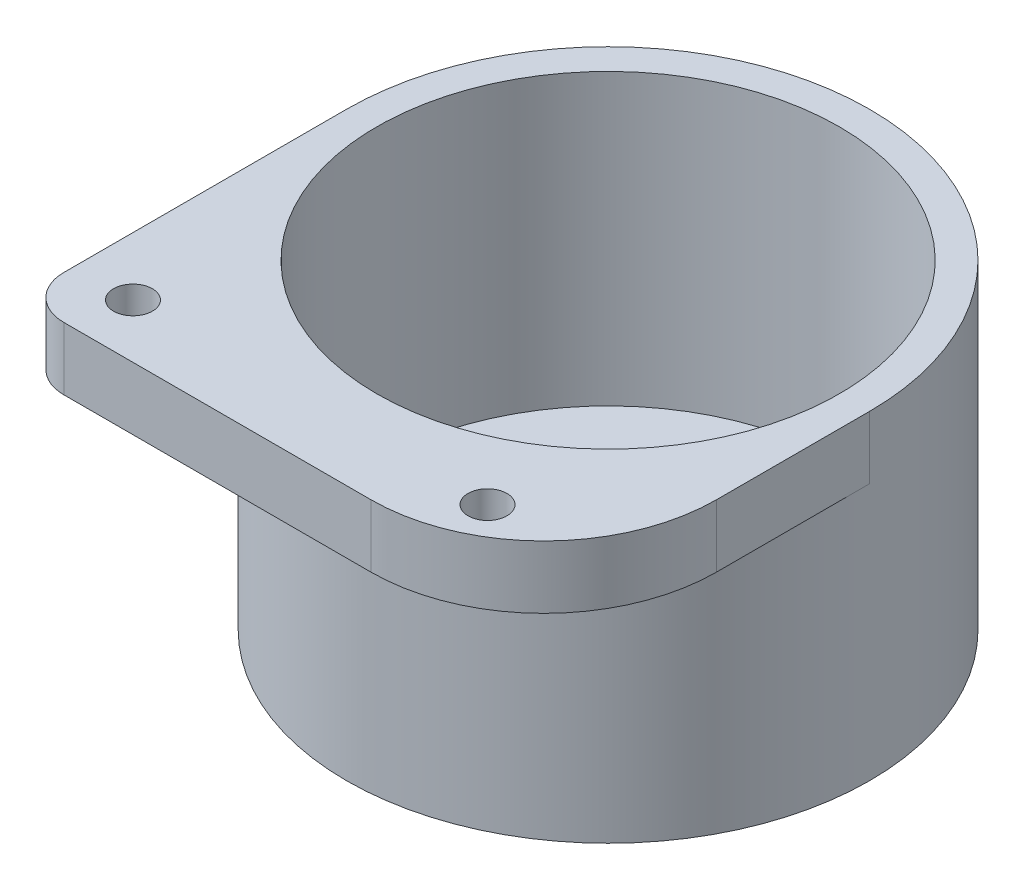
ISO-10303-21;
HEADER;
FILE_DESCRIPTION(('STEP AP214'),'2;1');
FILE_NAME('part.step','',(''),(''),'','','');
FILE_SCHEMA(('AUTOMOTIVE_DESIGN { 1 0 10303 214 1 1 1 1 }'));
ENDSEC;
DATA;
#1=APPLICATION_CONTEXT('core data for automotive mechanical design processes');
#2=APPLICATION_PROTOCOL_DEFINITION('international standard','automotive_design',2000,#1);
#3=PRODUCT_CONTEXT('',#1,'mechanical');
#4=PRODUCT('Part','Part','',(#3));
#5=PRODUCT_RELATED_PRODUCT_CATEGORY('part','',(#4));
#6=PRODUCT_DEFINITION_FORMATION('','',#4);
#7=PRODUCT_DEFINITION_CONTEXT('part definition',#1,'design');
#8=PRODUCT_DEFINITION('design','',#6,#7);
#9=PRODUCT_DEFINITION_SHAPE('','',#8);
#10=(LENGTH_UNIT() NAMED_UNIT(*) SI_UNIT(.MILLI.,.METRE.));
#11=(NAMED_UNIT(*) PLANE_ANGLE_UNIT() SI_UNIT($,.RADIAN.));
#12=(NAMED_UNIT(*) SI_UNIT($,.STERADIAN.) SOLID_ANGLE_UNIT());
#13=UNCERTAINTY_MEASURE_WITH_UNIT(LENGTH_MEASURE(1.E-05),#10,'distance_accuracy_value','');
#14=(GEOMETRIC_REPRESENTATION_CONTEXT(3) GLOBAL_UNCERTAINTY_ASSIGNED_CONTEXT((#13)) GLOBAL_UNIT_ASSIGNED_CONTEXT((#10,
#11,#12)) REPRESENTATION_CONTEXT('',''));
#15=CARTESIAN_POINT('',(0.,0.,0.));
#16=DIRECTION('',(0.,0.,1.));
#17=DIRECTION('',(1.,0.,0.));
#18=AXIS2_PLACEMENT_3D('',#15,#16,#17);
#19=CARTESIAN_POINT('',(0.,7.,0.));
#20=DIRECTION('',(0.,-1.,0.));
#21=DIRECTION('',(0.,0.,-1.));
#22=AXIS2_PLACEMENT_3D('',#19,#20,#21);
#23=CYLINDRICAL_SURFACE('',#22,60.5);
#24=CARTESIAN_POINT('',(0.,0.,0.));
#25=DIRECTION('',(0.,1.,0.));
#26=DIRECTION('',(0.,0.,1.));
#27=AXIS2_PLACEMENT_3D('',#24,#25,#26);
#28=CIRCLE('',#27,60.5);
#29=CARTESIAN_POINT('',(0.,0.,60.5));
#30=VERTEX_POINT('',#29);
#31=EDGE_CURVE('E49',#30,#30,#28,.T.);
#32=ORIENTED_EDGE('',*,*,#31,.T.);
#33=EDGE_LOOP('',(#32));
#34=FACE_BOUND('',#33,.T.);
#35=DIRECTION('',(0.,1.,0.));
#36=VECTOR('',#35,1.);
#37=CARTESIAN_POINT('',(-60.5,59.5,0.));
#38=LINE('',#37,#36);
#39=CARTESIAN_POINT('',(-60.5,59.5,0.));
#40=VERTEX_POINT('',#39);
#41=CARTESIAN_POINT('',(-60.5,74.,0.));
#42=VERTEX_POINT('',#41);
#43=EDGE_CURVE('E115',#40,#42,#38,.T.);
#44=ORIENTED_EDGE('',*,*,#43,.T.);
#45=CARTESIAN_POINT('',(0.,74.,0.));
#46=DIRECTION('',(0.,1.,0.));
#47=DIRECTION('',(0.,0.,1.));
#48=AXIS2_PLACEMENT_3D('',#45,#46,#47);
#49=CIRCLE('',#48,60.5);
#50=CARTESIAN_POINT('',(60.5,74.,0.));
#51=VERTEX_POINT('',#50);
#52=EDGE_CURVE('E189',#51,#42,#49,.T.);
#53=ORIENTED_EDGE('',*,*,#52,.F.);
#54=DIRECTION('',(0.,1.,0.));
#55=VECTOR('',#54,1.);
#56=CARTESIAN_POINT('',(60.5,59.5,0.));
#57=LINE('',#56,#55);
#58=CARTESIAN_POINT('',(60.5,59.5,0.));
#59=VERTEX_POINT('',#58);
#60=EDGE_CURVE('E172',#59,#51,#57,.T.);
#61=ORIENTED_EDGE('',*,*,#60,.F.);
#62=CARTESIAN_POINT('',(0.,59.5,0.));
#63=DIRECTION('',(0.,1.,0.));
#64=DIRECTION('',(0.,0.,1.));
#65=AXIS2_PLACEMENT_3D('',#62,#63,#64);
#66=CIRCLE('',#65,60.5);
#67=EDGE_CURVE('E128',#40,#59,#66,.T.);
#68=ORIENTED_EDGE('',*,*,#67,.F.);
#69=EDGE_LOOP('',(#44,#53,#61,#68));
#70=FACE_BOUND('',#69,.T.);
#71=ADVANCED_FACE('F41',(#34,#70),#23,.T.);
#72=CARTESIAN_POINT('',(0.,0.,0.));
#73=DIRECTION('',(0.,1.,0.));
#74=DIRECTION('',(0.,0.,1.));
#75=AXIS2_PLACEMENT_3D('',#72,#73,#74);
#76=PLANE('',#75);
#77=CARTESIAN_POINT('',(0.,0.,0.));
#78=DIRECTION('',(0.,1.,0.));
#79=DIRECTION('',(0.,0.,1.));
#80=AXIS2_PLACEMENT_3D('',#77,#78,#79);
#81=CIRCLE('',#80,17.75);
#82=CARTESIAN_POINT('',(0.,0.,17.75));
#83=VERTEX_POINT('',#82);
#84=EDGE_CURVE('E181',#83,#83,#81,.T.);
#85=ORIENTED_EDGE('',*,*,#84,.T.);
#86=EDGE_LOOP('',(#85));
#87=FACE_BOUND('',#86,.T.);
#88=ORIENTED_EDGE('',*,*,#31,.F.);
#89=EDGE_LOOP('',(#88));
#90=FACE_BOUND('',#89,.T.);
#91=ADVANCED_FACE('F197',(#87,#90),#76,.F.);
#92=CARTESIAN_POINT('',(0.,74.,0.));
#93=DIRECTION('',(0.,1.,0.));
#94=DIRECTION('',(0.,0.,1.));
#95=AXIS2_PLACEMENT_3D('',#92,#93,#94);
#96=PLANE('',#95);
#97=ORIENTED_EDGE('',*,*,#52,.T.);
#98=DIRECTION('',(0.,0.,1.));
#99=VECTOR('',#98,1.);
#100=CARTESIAN_POINT('',(-60.5,74.,0.));
#101=LINE('',#100,#99);
#102=CARTESIAN_POINT('',(-60.5,74.,65.3879454567716));
#103=VERTEX_POINT('',#102);
#104=EDGE_CURVE('E152',#42,#103,#101,.T.);
#105=ORIENTED_EDGE('',*,*,#104,.T.);
#106=CARTESIAN_POINT('',(-50.5,74.,65.3879454567716));
#107=DIRECTION('',(0.,1.,0.));
#108=DIRECTION('',(0.,0.,1.));
#109=AXIS2_PLACEMENT_3D('',#106,#107,#108);
#110=CIRCLE('',#109,10.);
#111=CARTESIAN_POINT('',(-50.4999999999999,74.,75.3879454567716));
#112=VERTEX_POINT('',#111);
#113=EDGE_CURVE('E109',#103,#112,#110,.T.);
#114=ORIENTED_EDGE('',*,*,#113,.T.);
#115=DIRECTION('',(1.,0.,0.));
#116=VECTOR('',#115,1.);
#117=CARTESIAN_POINT('',(0.,74.,75.3879454567716));
#118=LINE('',#117,#116);
#119=CARTESIAN_POINT('',(20.4999999999997,74.,75.3879454567716));
#120=VERTEX_POINT('',#119);
#121=EDGE_CURVE('E157',#112,#120,#118,.T.);
#122=ORIENTED_EDGE('',*,*,#121,.T.);
#123=CARTESIAN_POINT('',(20.5,74.,35.3879454567716));
#124=DIRECTION('',(0.,1.,0.));
#125=DIRECTION('',(0.,0.,1.));
#126=AXIS2_PLACEMENT_3D('',#123,#124,#125);
#127=CIRCLE('',#126,40.);
#128=CARTESIAN_POINT('',(60.5,74.,35.3879454567713));
#129=VERTEX_POINT('',#128);
#130=EDGE_CURVE('E147',#129,#120,#127,.F.);
#131=ORIENTED_EDGE('',*,*,#130,.F.);
#132=DIRECTION('',(0.,0.,1.));
#133=VECTOR('',#132,1.);
#134=CARTESIAN_POINT('',(60.5,74.,0.));
#135=LINE('',#134,#133);
#136=EDGE_CURVE('E56',#51,#129,#135,.T.);
#137=ORIENTED_EDGE('',*,*,#136,.F.);
#138=EDGE_LOOP('',(#97,#105,#114,#122,#131,#137));
#139=FACE_BOUND('',#138,.T.);
#140=CARTESIAN_POINT('',(0.,74.,0.));
#141=DIRECTION('',(0.,1.,0.));
#142=DIRECTION('',(0.,0.,1.));
#143=AXIS2_PLACEMENT_3D('',#140,#141,#142);
#144=CIRCLE('',#143,53.5);
#145=CARTESIAN_POINT('',(0.,74.,53.5));
#146=VERTEX_POINT('',#145);
#147=EDGE_CURVE('E185',#146,#146,#144,.T.);
#148=ORIENTED_EDGE('',*,*,#147,.F.);
#149=EDGE_LOOP('',(#148));
#150=FACE_BOUND('',#149,.T.);
#151=CARTESIAN_POINT('',(35.,74.,62.8902626069383));
#152=DIRECTION('',(0.,1.,0.));
#153=DIRECTION('',(0.,0.,1.));
#154=AXIS2_PLACEMENT_3D('',#151,#152,#153);
#155=CIRCLE('',#154,4.5);
#156=CARTESIAN_POINT('',(35.,74.,67.3902626069383));
#157=VERTEX_POINT('',#156);
#158=EDGE_CURVE('E143',#157,#157,#155,.T.);
#159=ORIENTED_EDGE('',*,*,#158,.F.);
#160=EDGE_LOOP('',(#159));
#161=FACE_BOUND('',#160,.T.);
#162=CARTESIAN_POINT('',(-47.,74.,62.8902626069383));
#163=DIRECTION('',(0.,1.,0.));
#164=DIRECTION('',(0.,0.,1.));
#165=AXIS2_PLACEMENT_3D('',#162,#163,#164);
#166=CIRCLE('',#165,4.5);
#167=CARTESIAN_POINT('',(-47.,74.,67.3902626069383));
#168=VERTEX_POINT('',#167);
#169=EDGE_CURVE('E161',#168,#168,#166,.T.);
#170=ORIENTED_EDGE('',*,*,#169,.F.);
#171=EDGE_LOOP('',(#170));
#172=FACE_BOUND('',#171,.T.);
#173=ADVANCED_FACE('F199',(#139,#150,#161,#172),#96,.T.);
#174=CARTESIAN_POINT('',(0.,74.,0.));
#175=DIRECTION('',(0.,-1.,0.));
#176=DIRECTION('',(0.,0.,-1.));
#177=AXIS2_PLACEMENT_3D('',#174,#175,#176);
#178=CYLINDRICAL_SURFACE('',#177,53.5);
#179=ORIENTED_EDGE('',*,*,#147,.T.);
#180=EDGE_LOOP('',(#179));
#181=FACE_BOUND('',#180,.T.);
#182=CARTESIAN_POINT('',(0.,7.00000000000001,0.));
#183=DIRECTION('',(0.,1.,0.));
#184=DIRECTION('',(0.,0.,1.));
#185=AXIS2_PLACEMENT_3D('',#182,#183,#184);
#186=CIRCLE('',#185,53.5);
#187=CARTESIAN_POINT('',(0.,7.00000000000001,53.5));
#188=VERTEX_POINT('',#187);
#189=EDGE_CURVE('E11',#188,#188,#186,.F.);
#190=ORIENTED_EDGE('',*,*,#189,.T.);
#191=EDGE_LOOP('',(#190));
#192=FACE_BOUND('',#191,.T.);
#193=ADVANCED_FACE('F205',(#181,#192),#178,.F.);
#194=CARTESIAN_POINT('',(0.,7.,0.));
#195=DIRECTION('',(0.,1.,0.));
#196=DIRECTION('',(0.,0.,1.));
#197=AXIS2_PLACEMENT_3D('',#194,#195,#196);
#198=PLANE('',#197);
#199=CARTESIAN_POINT('',(0.,7.,0.));
#200=DIRECTION('',(0.,1.,0.));
#201=DIRECTION('',(0.,0.,1.));
#202=AXIS2_PLACEMENT_3D('',#199,#200,#201);
#203=CIRCLE('',#202,17.75);
#204=CARTESIAN_POINT('',(0.,7.,17.75));
#205=VERTEX_POINT('',#204);
#206=EDGE_CURVE('E167',#205,#205,#203,.T.);
#207=ORIENTED_EDGE('',*,*,#206,.F.);
#208=EDGE_LOOP('',(#207));
#209=FACE_BOUND('',#208,.T.);
#210=ORIENTED_EDGE('',*,*,#189,.F.);
#211=EDGE_LOOP('',(#210));
#212=FACE_BOUND('',#211,.T.);
#213=ADVANCED_FACE('F208',(#209,#212),#198,.T.);
#214=CARTESIAN_POINT('',(0.,-47.,0.));
#215=DIRECTION('',(0.,1.,0.));
#216=DIRECTION('',(0.,0.,1.));
#217=AXIS2_PLACEMENT_3D('',#214,#215,#216);
#218=CYLINDRICAL_SURFACE('',#217,17.75);
#219=ORIENTED_EDGE('',*,*,#206,.T.);
#220=EDGE_LOOP('',(#219));
#221=FACE_BOUND('',#220,.T.);
#222=ORIENTED_EDGE('',*,*,#84,.F.);
#223=EDGE_LOOP('',(#222));
#224=FACE_BOUND('',#223,.T.);
#225=ADVANCED_FACE('F210',(#221,#224),#218,.F.);
#226=CARTESIAN_POINT('',(20.5,59.5,35.3879454567716));
#227=DIRECTION('',(0.,1.,0.));
#228=DIRECTION('',(0.,0.,1.));
#229=AXIS2_PLACEMENT_3D('',#226,#227,#228);
#230=CYLINDRICAL_SURFACE('',#229,40.);
#231=ORIENTED_EDGE('',*,*,#130,.T.);
#232=DIRECTION('',(0.,1.,0.));
#233=VECTOR('',#232,1.);
#234=CARTESIAN_POINT('',(20.4999999999997,59.5,75.3879454567716));
#235=LINE('',#234,#233);
#236=CARTESIAN_POINT('',(20.4999999999997,59.5,75.3879454567716));
#237=VERTEX_POINT('',#236);
#238=EDGE_CURVE('E88',#237,#120,#235,.T.);
#239=ORIENTED_EDGE('',*,*,#238,.F.);
#240=CARTESIAN_POINT('',(20.5,59.5,35.3879454567716));
#241=DIRECTION('',(0.,1.,0.));
#242=DIRECTION('',(0.,0.,1.));
#243=AXIS2_PLACEMENT_3D('',#240,#241,#242);
#244=CIRCLE('',#243,40.);
#245=CARTESIAN_POINT('',(60.5,59.5,35.3879454567713));
#246=VERTEX_POINT('',#245);
#247=EDGE_CURVE('E65',#246,#237,#244,.F.);
#248=ORIENTED_EDGE('',*,*,#247,.F.);
#249=DIRECTION('',(0.,1.,0.));
#250=VECTOR('',#249,1.);
#251=CARTESIAN_POINT('',(60.5,59.5,35.3879454567713));
#252=LINE('',#251,#250);
#253=EDGE_CURVE('E142',#246,#129,#252,.T.);
#254=ORIENTED_EDGE('',*,*,#253,.T.);
#255=EDGE_LOOP('',(#231,#239,#248,#254));
#256=FACE_BOUND('',#255,.T.);
#257=ADVANCED_FACE('F218',(#256),#230,.T.);
#258=CARTESIAN_POINT('',(0.,59.5,75.3879454567716));
#259=DIRECTION('',(0.,0.,1.));
#260=DIRECTION('',(1.,0.,0.));
#261=AXIS2_PLACEMENT_3D('',#258,#259,#260);
#262=PLANE('',#261);
#263=ORIENTED_EDGE('',*,*,#121,.F.);
#264=DIRECTION('',(0.,1.,0.));
#265=VECTOR('',#264,1.);
#266=CARTESIAN_POINT('',(-50.4999999999999,59.5,75.3879454567716));
#267=LINE('',#266,#265);
#268=CARTESIAN_POINT('',(-50.4999999999999,59.5,75.3879454567716));
#269=VERTEX_POINT('',#268);
#270=EDGE_CURVE('E114',#269,#112,#267,.T.);
#271=ORIENTED_EDGE('',*,*,#270,.F.);
#272=DIRECTION('',(1.,0.,0.));
#273=VECTOR('',#272,1.);
#274=CARTESIAN_POINT('',(0.,59.5,75.3879454567716));
#275=LINE('',#274,#273);
#276=EDGE_CURVE('E122',#269,#237,#275,.T.);
#277=ORIENTED_EDGE('',*,*,#276,.T.);
#278=ORIENTED_EDGE('',*,*,#238,.T.);
#279=EDGE_LOOP('',(#263,#271,#277,#278));
#280=FACE_BOUND('',#279,.T.);
#281=ADVANCED_FACE('F228',(#280),#262,.T.);
#282=CARTESIAN_POINT('',(-50.5,59.5,65.3879454567716));
#283=DIRECTION('',(0.,1.,0.));
#284=DIRECTION('',(0.,0.,1.));
#285=AXIS2_PLACEMENT_3D('',#282,#283,#284);
#286=CYLINDRICAL_SURFACE('',#285,10.);
#287=ORIENTED_EDGE('',*,*,#113,.F.);
#288=DIRECTION('',(0.,1.,0.));
#289=VECTOR('',#288,1.);
#290=CARTESIAN_POINT('',(-60.5,59.5,65.3879454567716));
#291=LINE('',#290,#289);
#292=CARTESIAN_POINT('',(-60.5,59.5,65.3879454567716));
#293=VERTEX_POINT('',#292);
#294=EDGE_CURVE('E104',#293,#103,#291,.T.);
#295=ORIENTED_EDGE('',*,*,#294,.F.);
#296=CARTESIAN_POINT('',(-50.5,59.5,65.3879454567716));
#297=DIRECTION('',(0.,1.,0.));
#298=DIRECTION('',(0.,0.,1.));
#299=AXIS2_PLACEMENT_3D('',#296,#297,#298);
#300=CIRCLE('',#299,10.);
#301=EDGE_CURVE('E107',#293,#269,#300,.T.);
#302=ORIENTED_EDGE('',*,*,#301,.T.);
#303=ORIENTED_EDGE('',*,*,#270,.T.);
#304=EDGE_LOOP('',(#287,#295,#302,#303));
#305=FACE_BOUND('',#304,.T.);
#306=ADVANCED_FACE('F106',(#305),#286,.T.);
#307=CARTESIAN_POINT('',(-60.5,59.5,0.));
#308=DIRECTION('',(-1.,0.,0.));
#309=DIRECTION('',(0.,0.,1.));
#310=AXIS2_PLACEMENT_3D('',#307,#308,#309);
#311=PLANE('',#310);
#312=ORIENTED_EDGE('',*,*,#104,.F.);
#313=ORIENTED_EDGE('',*,*,#43,.F.);
#314=DIRECTION('',(0.,0.,1.));
#315=VECTOR('',#314,1.);
#316=CARTESIAN_POINT('',(-60.5,59.5,0.));
#317=LINE('',#316,#315);
#318=EDGE_CURVE('E120',#40,#293,#317,.T.);
#319=ORIENTED_EDGE('',*,*,#318,.T.);
#320=ORIENTED_EDGE('',*,*,#294,.T.);
#321=EDGE_LOOP('',(#312,#313,#319,#320));
#322=FACE_BOUND('',#321,.T.);
#323=ADVANCED_FACE('F125',(#322),#311,.T.);
#324=CARTESIAN_POINT('',(60.5,59.5,0.));
#325=DIRECTION('',(-1.,0.,0.));
#326=DIRECTION('',(0.,0.,1.));
#327=AXIS2_PLACEMENT_3D('',#324,#325,#326);
#328=PLANE('',#327);
#329=ORIENTED_EDGE('',*,*,#136,.T.);
#330=ORIENTED_EDGE('',*,*,#253,.F.);
#331=DIRECTION('',(0.,0.,1.));
#332=VECTOR('',#331,1.);
#333=CARTESIAN_POINT('',(60.5,59.5,0.));
#334=LINE('',#333,#332);
#335=EDGE_CURVE('E94',#59,#246,#334,.T.);
#336=ORIENTED_EDGE('',*,*,#335,.F.);
#337=ORIENTED_EDGE('',*,*,#60,.T.);
#338=EDGE_LOOP('',(#329,#330,#336,#337));
#339=FACE_BOUND('',#338,.T.);
#340=ADVANCED_FACE('F224',(#339),#328,.F.);
#341=CARTESIAN_POINT('',(35.,59.5,62.8902626069383));
#342=DIRECTION('',(0.,1.,0.));
#343=DIRECTION('',(0.,0.,1.));
#344=AXIS2_PLACEMENT_3D('',#341,#342,#343);
#345=CYLINDRICAL_SURFACE('',#344,4.5);
#346=CARTESIAN_POINT('',(35.,59.5,62.8902626069383));
#347=DIRECTION('',(0.,1.,0.));
#348=DIRECTION('',(0.,0.,1.));
#349=AXIS2_PLACEMENT_3D('',#346,#347,#348);
#350=CIRCLE('',#349,4.5);
#351=CARTESIAN_POINT('',(35.,59.5,67.3902626069383));
#352=VERTEX_POINT('',#351);
#353=EDGE_CURVE('E164',#352,#352,#350,.T.);
#354=ORIENTED_EDGE('',*,*,#353,.F.);
#355=EDGE_LOOP('',(#354));
#356=FACE_BOUND('',#355,.T.);
#357=ORIENTED_EDGE('',*,*,#158,.T.);
#358=EDGE_LOOP('',(#357));
#359=FACE_BOUND('',#358,.T.);
#360=ADVANCED_FACE('F220',(#356,#359),#345,.F.);
#361=CARTESIAN_POINT('',(-47.,59.5,62.8902626069383));
#362=DIRECTION('',(0.,1.,0.));
#363=DIRECTION('',(0.,0.,1.));
#364=AXIS2_PLACEMENT_3D('',#361,#362,#363);
#365=CYLINDRICAL_SURFACE('',#364,4.5);
#366=CARTESIAN_POINT('',(-47.,59.5,62.8902626069383));
#367=DIRECTION('',(0.,1.,0.));
#368=DIRECTION('',(0.,0.,1.));
#369=AXIS2_PLACEMENT_3D('',#366,#367,#368);
#370=CIRCLE('',#369,4.5);
#371=CARTESIAN_POINT('',(-47.,59.5,67.3902626069383));
#372=VERTEX_POINT('',#371);
#373=EDGE_CURVE('E138',#372,#372,#370,.T.);
#374=ORIENTED_EDGE('',*,*,#373,.F.);
#375=EDGE_LOOP('',(#374));
#376=FACE_BOUND('',#375,.T.);
#377=ORIENTED_EDGE('',*,*,#169,.T.);
#378=EDGE_LOOP('',(#377));
#379=FACE_BOUND('',#378,.T.);
#380=ADVANCED_FACE('F223',(#376,#379),#365,.F.);
#381=CARTESIAN_POINT('',(0.,59.5,0.));
#382=DIRECTION('',(0.,1.,0.));
#383=DIRECTION('',(0.,0.,1.));
#384=AXIS2_PLACEMENT_3D('',#381,#382,#383);
#385=PLANE('',#384);
#386=ORIENTED_EDGE('',*,*,#353,.T.);
#387=EDGE_LOOP('',(#386));
#388=FACE_BOUND('',#387,.T.);
#389=ORIENTED_EDGE('',*,*,#247,.T.);
#390=ORIENTED_EDGE('',*,*,#276,.F.);
#391=ORIENTED_EDGE('',*,*,#301,.F.);
#392=ORIENTED_EDGE('',*,*,#318,.F.);
#393=ORIENTED_EDGE('',*,*,#67,.T.);
#394=ORIENTED_EDGE('',*,*,#335,.T.);
#395=EDGE_LOOP('',(#389,#390,#391,#392,#393,#394));
#396=FACE_BOUND('',#395,.T.);
#397=ORIENTED_EDGE('',*,*,#373,.T.);
#398=EDGE_LOOP('',(#397));
#399=FACE_BOUND('',#398,.T.);
#400=ADVANCED_FACE('F118',(#388,#396,#399),#385,.F.);
#401=CLOSED_SHELL('',(#71,#91,#173,#193,#213,#225,#257,#281,#306,#323,#340,#360,#380,#400));
#402=MANIFOLD_SOLID_BREP('B2',#401);
#403=ADVANCED_BREP_SHAPE_REPRESENTATION('',(#18,#402),#14);
#404=SHAPE_DEFINITION_REPRESENTATION(#9,#403);
ENDSEC;
END-ISO-10303-21;
